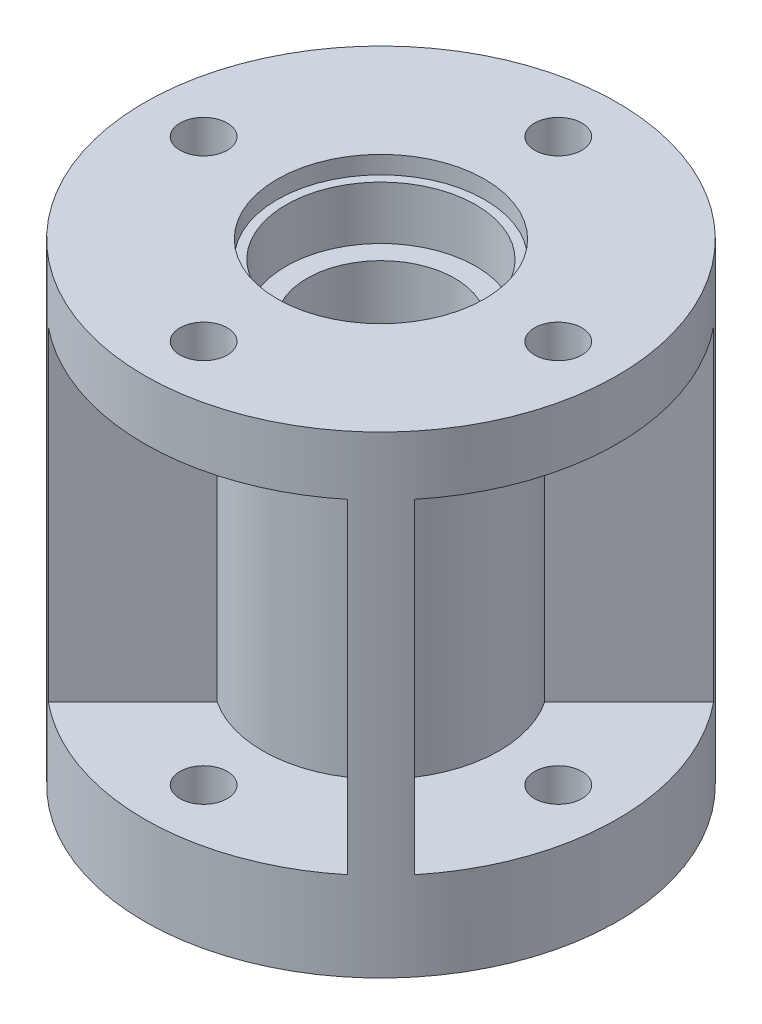
ISO-10303-21;
HEADER;
FILE_DESCRIPTION(('STEP AP214'),'2;1');
FILE_NAME('part.step','',(''),(''),'','','');
FILE_SCHEMA(('AUTOMOTIVE_DESIGN { 1 0 10303 214 1 1 1 1 }'));
ENDSEC;
DATA;
#1=APPLICATION_CONTEXT('core data for automotive mechanical design processes');
#2=APPLICATION_PROTOCOL_DEFINITION('international standard','automotive_design',2000,#1);
#3=PRODUCT_CONTEXT('',#1,'mechanical');
#4=PRODUCT('Part','Part','',(#3));
#5=PRODUCT_RELATED_PRODUCT_CATEGORY('part','',(#4));
#6=PRODUCT_DEFINITION_FORMATION('','',#4);
#7=PRODUCT_DEFINITION_CONTEXT('part definition',#1,'design');
#8=PRODUCT_DEFINITION('design','',#6,#7);
#9=PRODUCT_DEFINITION_SHAPE('','',#8);
#10=(LENGTH_UNIT() NAMED_UNIT(*) SI_UNIT(.MILLI.,.METRE.));
#11=(NAMED_UNIT(*) PLANE_ANGLE_UNIT() SI_UNIT($,.RADIAN.));
#12=(NAMED_UNIT(*) SI_UNIT($,.STERADIAN.) SOLID_ANGLE_UNIT());
#13=UNCERTAINTY_MEASURE_WITH_UNIT(LENGTH_MEASURE(1.E-05),#10,'distance_accuracy_value','');
#14=(GEOMETRIC_REPRESENTATION_CONTEXT(3) GLOBAL_UNCERTAINTY_ASSIGNED_CONTEXT((#13)) GLOBAL_UNIT_ASSIGNED_CONTEXT((#10,
#11,#12)) REPRESENTATION_CONTEXT('',''));
#15=CARTESIAN_POINT('',(0.,0.,0.));
#16=DIRECTION('',(0.,0.,1.));
#17=DIRECTION('',(1.,0.,0.));
#18=AXIS2_PLACEMENT_3D('',#15,#16,#17);
#19=CARTESIAN_POINT('',(0.,68.,0.));
#20=DIRECTION('',(0.,-1.,0.));
#21=DIRECTION('',(0.,0.,-1.));
#22=AXIS2_PLACEMENT_3D('',#19,#20,#21);
#23=CYLINDRICAL_SURFACE('',#22,20.);
#24=CARTESIAN_POINT('',(0.,70.,0.));
#25=DIRECTION('',(0.,1.,0.));
#26=DIRECTION('',(0.,0.,1.));
#27=AXIS2_PLACEMENT_3D('',#24,#25,#26);
#28=CIRCLE('',#27,20.);
#29=CARTESIAN_POINT('',(-11.0279793358048,70.,16.6848335852972));
#30=VERTEX_POINT('',#29);
#31=CARTESIAN_POINT('',(11.0279793358047,70.,16.6848335852973));
#32=VERTEX_POINT('',#31);
#33=EDGE_CURVE('E154',#30,#32,#28,.T.);
#34=ORIENTED_EDGE('',*,*,#33,.F.);
#35=DIRECTION('',(0.,-1.,0.));
#36=VECTOR('',#35,1.);
#37=CARTESIAN_POINT('',(-11.0279793358048,108.203579541999,16.6848335852972));
#38=LINE('',#37,#36);
#39=CARTESIAN_POINT('',(-11.0279793358048,15.,16.6848335852972));
#40=VERTEX_POINT('',#39);
#41=EDGE_CURVE('E224',#30,#40,#38,.T.);
#42=ORIENTED_EDGE('',*,*,#41,.T.);
#43=CARTESIAN_POINT('',(0.,15.,0.));
#44=DIRECTION('',(0.,1.,0.));
#45=DIRECTION('',(0.,0.,1.));
#46=AXIS2_PLACEMENT_3D('',#43,#44,#45);
#47=CIRCLE('',#46,20.);
#48=CARTESIAN_POINT('',(11.0279793358047,15.,16.6848335852973));
#49=VERTEX_POINT('',#48);
#50=EDGE_CURVE('E181',#40,#49,#47,.T.);
#51=ORIENTED_EDGE('',*,*,#50,.T.);
#52=DIRECTION('',(0.,-1.,0.));
#53=VECTOR('',#52,1.);
#54=CARTESIAN_POINT('',(11.0279793358047,108.203579541999,16.6848335852973));
#55=LINE('',#54,#53);
#56=EDGE_CURVE('E172',#32,#49,#55,.T.);
#57=ORIENTED_EDGE('',*,*,#56,.F.);
#58=EDGE_LOOP('',(#34,#42,#51,#57));
#59=FACE_BOUND('',#58,.T.);
#60=ADVANCED_FACE('F43',(#59),#23,.T.);
#61=CARTESIAN_POINT('',(16.6848335852971,70.,11.027979335805));
#62=VERTEX_POINT('',#61);
#63=CARTESIAN_POINT('',(16.6848335852973,70.,-11.0279793358048));
#64=VERTEX_POINT('',#63);
#65=EDGE_CURVE('E167',#62,#64,#28,.T.);
#66=ORIENTED_EDGE('',*,*,#65,.F.);
#67=DIRECTION('',(0.,-1.,0.));
#68=VECTOR('',#67,1.);
#69=CARTESIAN_POINT('',(16.6848335852971,108.203579541999,11.027979335805));
#70=LINE('',#69,#68);
#71=CARTESIAN_POINT('',(16.6848335852971,15.,11.027979335805));
#72=VERTEX_POINT('',#71);
#73=EDGE_CURVE('E184',#62,#72,#70,.T.);
#74=ORIENTED_EDGE('',*,*,#73,.T.);
#75=CARTESIAN_POINT('',(16.6848335852973,15.,-11.0279793358048));
#76=VERTEX_POINT('',#75);
#77=EDGE_CURVE('E274',#72,#76,#47,.T.);
#78=ORIENTED_EDGE('',*,*,#77,.T.);
#79=DIRECTION('',(0.,-1.,0.));
#80=VECTOR('',#79,1.);
#81=CARTESIAN_POINT('',(16.6848335852973,108.203579541999,-11.0279793358048));
#82=LINE('',#81,#80);
#83=EDGE_CURVE('E210',#64,#76,#82,.T.);
#84=ORIENTED_EDGE('',*,*,#83,.F.);
#85=EDGE_LOOP('',(#66,#74,#78,#84));
#86=FACE_BOUND('',#85,.T.);
#87=ADVANCED_FACE('F413',(#86),#23,.T.);
#88=CARTESIAN_POINT('',(11.0279793358049,70.,-16.6848335852972));
#89=VERTEX_POINT('',#88);
#90=CARTESIAN_POINT('',(-11.0279793358048,70.,-16.6848335852972));
#91=VERTEX_POINT('',#90);
#92=EDGE_CURVE('E415',#89,#91,#28,.T.);
#93=ORIENTED_EDGE('',*,*,#92,.F.);
#94=DIRECTION('',(0.,-1.,0.));
#95=VECTOR('',#94,1.);
#96=CARTESIAN_POINT('',(11.0279793358049,108.203579541999,-16.6848335852972));
#97=LINE('',#96,#95);
#98=CARTESIAN_POINT('',(11.0279793358049,15.,-16.6848335852972));
#99=VERTEX_POINT('',#98);
#100=EDGE_CURVE('E213',#89,#99,#97,.T.);
#101=ORIENTED_EDGE('',*,*,#100,.T.);
#102=CARTESIAN_POINT('',(-11.0279793358048,15.,-16.6848335852972));
#103=VERTEX_POINT('',#102);
#104=EDGE_CURVE('E365',#99,#103,#47,.T.);
#105=ORIENTED_EDGE('',*,*,#104,.T.);
#106=DIRECTION('',(0.,-1.,0.));
#107=VECTOR('',#106,1.);
#108=CARTESIAN_POINT('',(-11.0279793358048,108.203579541999,-16.6848335852972));
#109=LINE('',#108,#107);
#110=EDGE_CURVE('E231',#91,#103,#109,.T.);
#111=ORIENTED_EDGE('',*,*,#110,.F.);
#112=EDGE_LOOP('',(#93,#101,#105,#111));
#113=FACE_BOUND('',#112,.T.);
#114=ADVANCED_FACE('F451',(#113),#23,.T.);
#115=CARTESIAN_POINT('',(-16.6848335852972,70.,-11.0279793358049));
#116=VERTEX_POINT('',#115);
#117=CARTESIAN_POINT('',(-16.6848335852972,70.,11.0279793358049));
#118=VERTEX_POINT('',#117);
#119=EDGE_CURVE('E164',#116,#118,#28,.T.);
#120=ORIENTED_EDGE('',*,*,#119,.F.);
#121=DIRECTION('',(0.,-1.,0.));
#122=VECTOR('',#121,1.);
#123=CARTESIAN_POINT('',(-16.6848335852972,108.203579541999,-11.0279793358049));
#124=LINE('',#123,#122);
#125=CARTESIAN_POINT('',(-16.6848335852972,15.,-11.0279793358049));
#126=VERTEX_POINT('',#125);
#127=EDGE_CURVE('E203',#116,#126,#124,.T.);
#128=ORIENTED_EDGE('',*,*,#127,.T.);
#129=CARTESIAN_POINT('',(-16.6848335852972,15.,11.0279793358049));
#130=VERTEX_POINT('',#129);
#131=EDGE_CURVE('E270',#126,#130,#47,.T.);
#132=ORIENTED_EDGE('',*,*,#131,.T.);
#133=DIRECTION('',(0.,-1.,0.));
#134=VECTOR('',#133,1.);
#135=CARTESIAN_POINT('',(-16.6848335852972,108.203579541999,11.0279793358049));
#136=LINE('',#135,#134);
#137=EDGE_CURVE('E249',#118,#130,#136,.T.);
#138=ORIENTED_EDGE('',*,*,#137,.F.);
#139=EDGE_LOOP('',(#120,#128,#132,#138));
#140=FACE_BOUND('',#139,.T.);
#141=ADVANCED_FACE('F379',(#140),#23,.T.);
#142=CARTESIAN_POINT('',(-16.6848335852972,108.203579541999,11.0279793358049));
#143=DIRECTION('',(0.707106781186549,0.,0.707106781186546));
#144=DIRECTION('',(0.707106781186546,0.,-0.707106781186549));
#145=AXIS2_PLACEMENT_3D('',#142,#143,#144);
#146=PLANE('',#145);
#147=DIRECTION('',(-0.707106781186546,0.,0.707106781186549));
#148=VECTOR('',#147,1.);
#149=CARTESIAN_POINT('',(-16.6848335852972,70.,11.0279793358049));
#150=LINE('',#149,#148);
#151=CARTESIAN_POINT('',(-30.9709216836867,70.,25.3140674341945));
#152=VERTEX_POINT('',#151);
#153=EDGE_CURVE('E338',#118,#152,#150,.T.);
#154=ORIENTED_EDGE('',*,*,#153,.F.);
#155=ORIENTED_EDGE('',*,*,#137,.T.);
#156=DIRECTION('',(-0.707106781186546,0.,0.707106781186549));
#157=VECTOR('',#156,1.);
#158=CARTESIAN_POINT('',(-16.6848335852972,15.,11.0279793358049));
#159=LINE('',#158,#157);
#160=CARTESIAN_POINT('',(-30.9709216836867,15.,25.3140674341945));
#161=VERTEX_POINT('',#160);
#162=EDGE_CURVE('E244',#130,#161,#159,.T.);
#163=ORIENTED_EDGE('',*,*,#162,.T.);
#164=DIRECTION('',(0.,-1.,0.));
#165=VECTOR('',#164,1.);
#166=CARTESIAN_POINT('',(-30.9709216836867,108.203579541999,25.3140674341945));
#167=LINE('',#166,#165);
#168=EDGE_CURVE('E248',#152,#161,#167,.T.);
#169=ORIENTED_EDGE('',*,*,#168,.F.);
#170=EDGE_LOOP('',(#154,#155,#163,#169));
#171=FACE_BOUND('',#170,.T.);
#172=ADVANCED_FACE('F389',(#171),#146,.F.);
#173=CARTESIAN_POINT('',(-11.0279793358048,108.203579541999,16.6848335852972));
#174=DIRECTION('',(-0.707106781186549,0.,-0.707106781186546));
#175=DIRECTION('',(-0.707106781186546,0.,0.707106781186549));
#176=AXIS2_PLACEMENT_3D('',#173,#174,#175);
#177=PLANE('',#176);
#178=DIRECTION('',(0.707106781186546,0.,-0.707106781186549));
#179=VECTOR('',#178,1.);
#180=CARTESIAN_POINT('',(-11.0279793358048,70.,16.6848335852972));
#181=LINE('',#180,#179);
#182=CARTESIAN_POINT('',(-25.3140674341943,70.,30.9709216836868));
#183=VERTEX_POINT('',#182);
#184=EDGE_CURVE('E159',#183,#30,#181,.T.);
#185=ORIENTED_EDGE('',*,*,#184,.F.);
#186=DIRECTION('',(0.,-1.,0.));
#187=VECTOR('',#186,1.);
#188=CARTESIAN_POINT('',(-25.3140674341943,108.203579541999,30.9709216836868));
#189=LINE('',#188,#187);
#190=CARTESIAN_POINT('',(-25.3140674341943,15.,30.9709216836868));
#191=VERTEX_POINT('',#190);
#192=EDGE_CURVE('E63',#183,#191,#189,.T.);
#193=ORIENTED_EDGE('',*,*,#192,.T.);
#194=DIRECTION('',(0.707106781186546,0.,-0.707106781186549));
#195=VECTOR('',#194,1.);
#196=CARTESIAN_POINT('',(-11.0279793358048,15.,16.6848335852972));
#197=LINE('',#196,#195);
#198=EDGE_CURVE('E240',#191,#40,#197,.T.);
#199=ORIENTED_EDGE('',*,*,#198,.T.);
#200=ORIENTED_EDGE('',*,*,#41,.F.);
#201=EDGE_LOOP('',(#185,#193,#199,#200));
#202=FACE_BOUND('',#201,.T.);
#203=ADVANCED_FACE('F459',(#202),#177,.F.);
#204=CARTESIAN_POINT('',(-11.0279793358048,108.203579541999,-16.6848335852972));
#205=DIRECTION('',(-0.707106781186548,0.,0.707106781186547));
#206=DIRECTION('',(0.707106781186547,0.,0.707106781186548));
#207=AXIS2_PLACEMENT_3D('',#204,#205,#206);
#208=PLANE('',#207);
#209=DIRECTION('',(-0.707106781186547,0.,-0.707106781186548));
#210=VECTOR('',#209,1.);
#211=CARTESIAN_POINT('',(-11.0279793358048,70.,-16.6848335852972));
#212=LINE('',#211,#210);
#213=CARTESIAN_POINT('',(-25.3140674341943,70.,-30.9709216836868));
#214=VERTEX_POINT('',#213);
#215=EDGE_CURVE('E333',#91,#214,#212,.T.);
#216=ORIENTED_EDGE('',*,*,#215,.F.);
#217=ORIENTED_EDGE('',*,*,#110,.T.);
#218=DIRECTION('',(-0.707106781186546,0.,-0.707106781186548));
#219=VECTOR('',#218,1.);
#220=CARTESIAN_POINT('',(-11.0279793358048,15.,-16.6848335852972));
#221=LINE('',#220,#219);
#222=CARTESIAN_POINT('',(-25.3140674341943,15.,-30.9709216836868));
#223=VERTEX_POINT('',#222);
#224=EDGE_CURVE('E226',#103,#223,#221,.T.);
#225=ORIENTED_EDGE('',*,*,#224,.T.);
#226=DIRECTION('',(0.,-1.,0.));
#227=VECTOR('',#226,1.);
#228=CARTESIAN_POINT('',(-25.3140674341943,108.203579541999,-30.9709216836868));
#229=LINE('',#228,#227);
#230=EDGE_CURVE('E230',#214,#223,#229,.T.);
#231=ORIENTED_EDGE('',*,*,#230,.F.);
#232=EDGE_LOOP('',(#216,#217,#225,#231));
#233=FACE_BOUND('',#232,.T.);
#234=ADVANCED_FACE('F474',(#233),#208,.F.);
#235=CARTESIAN_POINT('',(-16.6848335852972,108.203579541999,-11.0279793358049));
#236=DIRECTION('',(0.707106781186548,0.,-0.707106781186547));
#237=DIRECTION('',(-0.707106781186547,0.,-0.707106781186548));
#238=AXIS2_PLACEMENT_3D('',#235,#236,#237);
#239=PLANE('',#238);
#240=DIRECTION('',(0.707106781186547,0.,0.707106781186548));
#241=VECTOR('',#240,1.);
#242=CARTESIAN_POINT('',(-16.6848335852972,70.,-11.0279793358049));
#243=LINE('',#242,#241);
#244=CARTESIAN_POINT('',(-30.9709216836867,70.,-25.3140674341944));
#245=VERTEX_POINT('',#244);
#246=EDGE_CURVE('E330',#245,#116,#243,.T.);
#247=ORIENTED_EDGE('',*,*,#246,.F.);
#248=DIRECTION('',(0.,-1.,0.));
#249=VECTOR('',#248,1.);
#250=CARTESIAN_POINT('',(-30.9709216836867,108.203579541999,-25.3140674341944));
#251=LINE('',#250,#249);
#252=CARTESIAN_POINT('',(-30.9709216836867,15.,-25.3140674341944));
#253=VERTEX_POINT('',#252);
#254=EDGE_CURVE('E225',#245,#253,#251,.T.);
#255=ORIENTED_EDGE('',*,*,#254,.T.);
#256=DIRECTION('',(0.707106781186547,0.,0.707106781186548));
#257=VECTOR('',#256,1.);
#258=CARTESIAN_POINT('',(-16.6848335852972,15.,-11.0279793358049));
#259=LINE('',#258,#257);
#260=EDGE_CURVE('E220',#253,#126,#259,.T.);
#261=ORIENTED_EDGE('',*,*,#260,.T.);
#262=ORIENTED_EDGE('',*,*,#127,.F.);
#263=EDGE_LOOP('',(#247,#255,#261,#262));
#264=FACE_BOUND('',#263,.T.);
#265=ADVANCED_FACE('F599',(#264),#239,.F.);
#266=CARTESIAN_POINT('',(16.6848335852973,108.203579541999,-11.0279793358048));
#267=DIRECTION('',(-0.707106781186544,0.,-0.707106781186551));
#268=DIRECTION('',(-0.707106781186551,0.,0.707106781186544));
#269=AXIS2_PLACEMENT_3D('',#266,#267,#268);
#270=PLANE('',#269);
#271=DIRECTION('',(0.707106781186551,0.,-0.707106781186544));
#272=VECTOR('',#271,1.);
#273=CARTESIAN_POINT('',(16.6848335852973,70.,-11.0279793358048));
#274=LINE('',#273,#272);
#275=CARTESIAN_POINT('',(30.9709216836869,70.,-25.3140674341942));
#276=VERTEX_POINT('',#275);
#277=EDGE_CURVE('E327',#64,#276,#274,.T.);
#278=ORIENTED_EDGE('',*,*,#277,.F.);
#279=ORIENTED_EDGE('',*,*,#83,.T.);
#280=DIRECTION('',(0.707106781186551,0.,-0.707106781186544));
#281=VECTOR('',#280,1.);
#282=CARTESIAN_POINT('',(16.6848335852973,15.,-11.0279793358048));
#283=LINE('',#282,#281);
#284=CARTESIAN_POINT('',(30.9709216836869,15.,-25.3140674341942));
#285=VERTEX_POINT('',#284);
#286=EDGE_CURVE('E205',#76,#285,#283,.T.);
#287=ORIENTED_EDGE('',*,*,#286,.T.);
#288=DIRECTION('',(0.,-1.,0.));
#289=VECTOR('',#288,1.);
#290=CARTESIAN_POINT('',(30.9709216836869,108.203579541999,-25.3140674341942));
#291=LINE('',#290,#289);
#292=EDGE_CURVE('E209',#276,#285,#291,.T.);
#293=ORIENTED_EDGE('',*,*,#292,.F.);
#294=EDGE_LOOP('',(#278,#279,#287,#293));
#295=FACE_BOUND('',#294,.T.);
#296=ADVANCED_FACE('F411',(#295),#270,.F.);
#297=CARTESIAN_POINT('',(11.0279793358049,108.203579541999,-16.6848335852972));
#298=DIRECTION('',(0.707106781186544,0.,0.707106781186551));
#299=DIRECTION('',(0.707106781186551,0.,-0.707106781186544));
#300=AXIS2_PLACEMENT_3D('',#297,#298,#299);
#301=PLANE('',#300);
#302=DIRECTION('',(-0.707106781186551,0.,0.707106781186544));
#303=VECTOR('',#302,1.);
#304=CARTESIAN_POINT('',(11.0279793358049,70.,-16.6848335852972));
#305=LINE('',#304,#303);
#306=CARTESIAN_POINT('',(25.3140674341945,70.,-30.9709216836866));
#307=VERTEX_POINT('',#306);
#308=EDGE_CURVE('E176',#307,#89,#305,.T.);
#309=ORIENTED_EDGE('',*,*,#308,.F.);
#310=DIRECTION('',(0.,-1.,0.));
#311=VECTOR('',#310,1.);
#312=CARTESIAN_POINT('',(25.3140674341945,108.203579541999,-30.9709216836866));
#313=LINE('',#312,#311);
#314=CARTESIAN_POINT('',(25.3140674341945,15.,-30.9709216836866));
#315=VERTEX_POINT('',#314);
#316=EDGE_CURVE('E204',#307,#315,#313,.T.);
#317=ORIENTED_EDGE('',*,*,#316,.T.);
#318=DIRECTION('',(-0.707106781186551,0.,0.707106781186544));
#319=VECTOR('',#318,1.);
#320=CARTESIAN_POINT('',(11.0279793358049,15.,-16.6848335852972));
#321=LINE('',#320,#319);
#322=EDGE_CURVE('E199',#315,#99,#321,.T.);
#323=ORIENTED_EDGE('',*,*,#322,.T.);
#324=ORIENTED_EDGE('',*,*,#100,.F.);
#325=EDGE_LOOP('',(#309,#317,#323,#324));
#326=FACE_BOUND('',#325,.T.);
#327=ADVANCED_FACE('F466',(#326),#301,.F.);
#328=CARTESIAN_POINT('',(11.0279793358047,108.203579541999,16.6848335852973));
#329=DIRECTION('',(0.707106781186554,0.,-0.707106781186542));
#330=DIRECTION('',(-0.707106781186542,0.,-0.707106781186554));
#331=AXIS2_PLACEMENT_3D('',#328,#329,#330);
#332=PLANE('',#331);
#333=DIRECTION('',(0.707106781186542,0.,0.707106781186554));
#334=VECTOR('',#333,1.);
#335=CARTESIAN_POINT('',(11.0279793358047,70.,16.6848335852973));
#336=LINE('',#335,#334);
#337=CARTESIAN_POINT('',(25.3140674341941,70.,30.970921683687));
#338=VERTEX_POINT('',#337);
#339=EDGE_CURVE('E157',#32,#338,#336,.T.);
#340=ORIENTED_EDGE('',*,*,#339,.F.);
#341=ORIENTED_EDGE('',*,*,#56,.T.);
#342=DIRECTION('',(0.707106781186542,0.,0.707106781186554));
#343=VECTOR('',#342,1.);
#344=CARTESIAN_POINT('',(11.0279793358047,15.,16.6848335852973));
#345=LINE('',#344,#343);
#346=CARTESIAN_POINT('',(25.3140674341941,15.,30.970921683687));
#347=VERTEX_POINT('',#346);
#348=EDGE_CURVE('E183',#49,#347,#345,.T.);
#349=ORIENTED_EDGE('',*,*,#348,.T.);
#350=DIRECTION('',(0.,-1.,0.));
#351=VECTOR('',#350,1.);
#352=CARTESIAN_POINT('',(25.3140674341941,108.203579541999,30.970921683687));
#353=LINE('',#352,#351);
#354=EDGE_CURVE('E174',#338,#347,#353,.T.);
#355=ORIENTED_EDGE('',*,*,#354,.F.);
#356=EDGE_LOOP('',(#340,#341,#349,#355));
#357=FACE_BOUND('',#356,.T.);
#358=ADVANCED_FACE('F170',(#357),#332,.F.);
#359=CARTESIAN_POINT('',(16.6848335852971,108.203579541999,11.027979335805));
#360=DIRECTION('',(-0.707106781186553,0.,0.707106781186542));
#361=DIRECTION('',(0.707106781186542,0.,0.707106781186553));
#362=AXIS2_PLACEMENT_3D('',#359,#360,#361);
#363=PLANE('',#362);
#364=DIRECTION('',(-0.707106781186542,0.,-0.707106781186553));
#365=VECTOR('',#364,1.);
#366=CARTESIAN_POINT('',(16.6848335852971,70.,11.027979335805));
#367=LINE('',#366,#365);
#368=CARTESIAN_POINT('',(30.9709216836866,70.,25.3140674341946));
#369=VERTEX_POINT('',#368);
#370=EDGE_CURVE('E11',#369,#62,#367,.T.);
#371=ORIENTED_EDGE('',*,*,#370,.F.);
#372=DIRECTION('',(0.,-1.,0.));
#373=VECTOR('',#372,1.);
#374=CARTESIAN_POINT('',(30.9709216836866,108.203579541999,25.3140674341946));
#375=LINE('',#374,#373);
#376=CARTESIAN_POINT('',(30.9709216836866,15.,25.3140674341946));
#377=VERTEX_POINT('',#376);
#378=EDGE_CURVE('E195',#369,#377,#375,.T.);
#379=ORIENTED_EDGE('',*,*,#378,.T.);
#380=DIRECTION('',(-0.707106781186542,0.,-0.707106781186553));
#381=VECTOR('',#380,1.);
#382=CARTESIAN_POINT('',(16.6848335852971,15.,11.027979335805));
#383=LINE('',#382,#381);
#384=EDGE_CURVE('E197',#377,#72,#383,.T.);
#385=ORIENTED_EDGE('',*,*,#384,.T.);
#386=ORIENTED_EDGE('',*,*,#73,.F.);
#387=EDGE_LOOP('',(#371,#379,#385,#386));
#388=FACE_BOUND('',#387,.T.);
#389=ADVANCED_FACE('F354',(#388),#363,.F.);
#390=CARTESIAN_POINT('',(0.,80.,0.));
#391=DIRECTION('',(0.,-1.,0.));
#392=DIRECTION('',(0.,0.,-1.));
#393=AXIS2_PLACEMENT_3D('',#390,#391,#392);
#394=CYLINDRICAL_SURFACE('',#393,16.05);
#395=CARTESIAN_POINT('',(0.,68.,0.));
#396=DIRECTION('',(0.,1.,0.));
#397=DIRECTION('',(0.,0.,1.));
#398=AXIS2_PLACEMENT_3D('',#395,#396,#397);
#399=CIRCLE('',#398,16.05);
#400=CARTESIAN_POINT('',(0.,68.,16.05));
#401=VERTEX_POINT('',#400);
#402=EDGE_CURVE('E253',#401,#401,#399,.T.);
#403=ORIENTED_EDGE('',*,*,#402,.F.);
#404=EDGE_LOOP('',(#403));
#405=FACE_BOUND('',#404,.T.);
#406=CARTESIAN_POINT('',(0.,77.,0.));
#407=DIRECTION('',(0.,1.,0.));
#408=DIRECTION('',(0.,0.,1.));
#409=AXIS2_PLACEMENT_3D('',#406,#407,#408);
#410=CIRCLE('',#409,16.05);
#411=CARTESIAN_POINT('',(0.,77.,16.05));
#412=VERTEX_POINT('',#411);
#413=EDGE_CURVE('E189',#412,#412,#410,.T.);
#414=ORIENTED_EDGE('',*,*,#413,.T.);
#415=EDGE_LOOP('',(#414));
#416=FACE_BOUND('',#415,.T.);
#417=ADVANCED_FACE('F498',(#405,#416),#394,.F.);
#418=CARTESIAN_POINT('',(0.,15.,0.));
#419=DIRECTION('',(0.,1.,0.));
#420=DIRECTION('',(0.,0.,1.));
#421=AXIS2_PLACEMENT_3D('',#418,#419,#420);
#422=PLANE('',#421);
#423=CARTESIAN_POINT('',(-1.02907469966573E-13,15.,30.0000000000001));
#424=DIRECTION('',(0.,1.,0.));
#425=DIRECTION('',(0.,0.,1.));
#426=AXIS2_PLACEMENT_3D('',#423,#424,#425);
#427=CIRCLE('',#426,4.00000000000007);
#428=CARTESIAN_POINT('',(-1.02907469966573E-13,15.,34.0000000000002));
#429=VERTEX_POINT('',#428);
#430=EDGE_CURVE('E304',#429,#429,#427,.F.);
#431=ORIENTED_EDGE('',*,*,#430,.T.);
#432=EDGE_LOOP('',(#431));
#433=FACE_BOUND('',#432,.T.);
#434=CARTESIAN_POINT('',(0.,15.,0.));
#435=DIRECTION('',(0.,1.,0.));
#436=DIRECTION('',(0.,0.,1.));
#437=AXIS2_PLACEMENT_3D('',#434,#435,#436);
#438=CIRCLE('',#437,40.);
#439=EDGE_CURVE('E54',#191,#347,#438,.T.);
#440=ORIENTED_EDGE('',*,*,#439,.T.);
#441=ORIENTED_EDGE('',*,*,#348,.F.);
#442=ORIENTED_EDGE('',*,*,#50,.F.);
#443=ORIENTED_EDGE('',*,*,#198,.F.);
#444=EDGE_LOOP('',(#440,#441,#442,#443));
#445=FACE_BOUND('',#444,.T.);
#446=ADVANCED_FACE('F496',(#433,#445),#422,.T.);
#447=CARTESIAN_POINT('',(30.,15.,1.04744440165294E-13));
#448=DIRECTION('',(0.,1.,0.));
#449=DIRECTION('',(0.,0.,1.));
#450=AXIS2_PLACEMENT_3D('',#447,#448,#449);
#451=CIRCLE('',#450,4.);
#452=CARTESIAN_POINT('',(30.,15.,4.0000000000001));
#453=VERTEX_POINT('',#452);
#454=EDGE_CURVE('E165',#453,#453,#451,.F.);
#455=ORIENTED_EDGE('',*,*,#454,.T.);
#456=EDGE_LOOP('',(#455));
#457=FACE_BOUND('',#456,.T.);
#458=ORIENTED_EDGE('',*,*,#77,.F.);
#459=ORIENTED_EDGE('',*,*,#384,.F.);
#460=EDGE_CURVE('E282',#377,#285,#438,.T.);
#461=ORIENTED_EDGE('',*,*,#460,.T.);
#462=ORIENTED_EDGE('',*,*,#286,.F.);
#463=EDGE_LOOP('',(#458,#459,#461,#462));
#464=FACE_BOUND('',#463,.T.);
#465=ADVANCED_FACE('F361',(#457,#464),#422,.T.);
#466=CARTESIAN_POINT('',(0.,15.,-30.));
#467=DIRECTION('',(0.,1.,0.));
#468=DIRECTION('',(0.,0.,1.));
#469=AXIS2_PLACEMENT_3D('',#466,#467,#468);
#470=CIRCLE('',#469,4.);
#471=CARTESIAN_POINT('',(0.,15.,-26.));
#472=VERTEX_POINT('',#471);
#473=EDGE_CURVE('E300',#472,#472,#470,.F.);
#474=ORIENTED_EDGE('',*,*,#473,.T.);
#475=EDGE_LOOP('',(#474));
#476=FACE_BOUND('',#475,.T.);
#477=ORIENTED_EDGE('',*,*,#104,.F.);
#478=ORIENTED_EDGE('',*,*,#322,.F.);
#479=EDGE_CURVE('E472',#315,#223,#438,.T.);
#480=ORIENTED_EDGE('',*,*,#479,.T.);
#481=ORIENTED_EDGE('',*,*,#224,.F.);
#482=EDGE_LOOP('',(#477,#478,#480,#481));
#483=FACE_BOUND('',#482,.T.);
#484=ADVANCED_FACE('F471',(#476,#483),#422,.T.);
#485=CARTESIAN_POINT('',(-29.9999999999996,15.,4.2632564145606E-13));
#486=DIRECTION('',(0.,1.,0.));
#487=DIRECTION('',(0.,0.,1.));
#488=AXIS2_PLACEMENT_3D('',#485,#486,#487);
#489=CIRCLE('',#488,4.00000000000083);
#490=CARTESIAN_POINT('',(-29.9999999999996,15.,4.00000000000126));
#491=VERTEX_POINT('',#490);
#492=EDGE_CURVE('E295',#491,#491,#489,.F.);
#493=ORIENTED_EDGE('',*,*,#492,.T.);
#494=EDGE_LOOP('',(#493));
#495=FACE_BOUND('',#494,.T.);
#496=ORIENTED_EDGE('',*,*,#131,.F.);
#497=ORIENTED_EDGE('',*,*,#260,.F.);
#498=EDGE_CURVE('E283',#253,#161,#438,.T.);
#499=ORIENTED_EDGE('',*,*,#498,.T.);
#500=ORIENTED_EDGE('',*,*,#162,.F.);
#501=EDGE_LOOP('',(#496,#497,#499,#500));
#502=FACE_BOUND('',#501,.T.);
#503=ADVANCED_FACE('F384',(#495,#502),#422,.T.);
#504=CARTESIAN_POINT('',(0.,68.,0.));
#505=DIRECTION('',(0.,1.,0.));
#506=DIRECTION('',(0.,0.,1.));
#507=AXIS2_PLACEMENT_3D('',#504,#505,#506);
#508=PLANE('',#507);
#509=CARTESIAN_POINT('',(0.,68.,0.));
#510=DIRECTION('',(0.,1.,0.));
#511=DIRECTION('',(0.,0.,1.));
#512=AXIS2_PLACEMENT_3D('',#509,#510,#511);
#513=CIRCLE('',#512,12.5);
#514=CARTESIAN_POINT('',(0.,68.,12.5));
#515=VERTEX_POINT('',#514);
#516=EDGE_CURVE('E266',#515,#515,#513,.T.);
#517=ORIENTED_EDGE('',*,*,#516,.F.);
#518=EDGE_LOOP('',(#517));
#519=FACE_BOUND('',#518,.T.);
#520=ORIENTED_EDGE('',*,*,#402,.T.);
#521=EDGE_LOOP('',(#520));
#522=FACE_BOUND('',#521,.T.);
#523=ADVANCED_FACE('F487',(#519,#522),#508,.T.);
#524=CARTESIAN_POINT('',(0.,0.,0.));
#525=DIRECTION('',(0.,1.,0.));
#526=DIRECTION('',(0.,0.,1.));
#527=AXIS2_PLACEMENT_3D('',#524,#525,#526);
#528=PLANE('',#527);
#529=CARTESIAN_POINT('',(0.,0.,-30.));
#530=DIRECTION('',(0.,1.,0.));
#531=DIRECTION('',(0.,0.,1.));
#532=AXIS2_PLACEMENT_3D('',#529,#530,#531);
#533=CIRCLE('',#532,4.);
#534=CARTESIAN_POINT('',(0.,0.,-26.));
#535=VERTEX_POINT('',#534);
#536=EDGE_CURVE('E520',#535,#535,#533,.T.);
#537=ORIENTED_EDGE('',*,*,#536,.T.);
#538=EDGE_LOOP('',(#537));
#539=FACE_BOUND('',#538,.T.);
#540=CARTESIAN_POINT('',(30.,0.,1.04744440165294E-13));
#541=DIRECTION('',(0.,1.,0.));
#542=DIRECTION('',(0.,0.,1.));
#543=AXIS2_PLACEMENT_3D('',#540,#541,#542);
#544=CIRCLE('',#543,4.);
#545=CARTESIAN_POINT('',(30.,0.,4.0000000000001));
#546=VERTEX_POINT('',#545);
#547=EDGE_CURVE('E527',#546,#546,#544,.T.);
#548=ORIENTED_EDGE('',*,*,#547,.T.);
#549=EDGE_LOOP('',(#548));
#550=FACE_BOUND('',#549,.T.);
#551=CARTESIAN_POINT('',(-1.02907469966573E-13,0.,30.0000000000001));
#552=DIRECTION('',(0.,1.,0.));
#553=DIRECTION('',(0.,0.,1.));
#554=AXIS2_PLACEMENT_3D('',#551,#552,#553);
#555=CIRCLE('',#554,4.00000000000007);
#556=CARTESIAN_POINT('',(-1.02907469966573E-13,0.,34.0000000000002));
#557=VERTEX_POINT('',#556);
#558=EDGE_CURVE('E535',#557,#557,#555,.T.);
#559=ORIENTED_EDGE('',*,*,#558,.T.);
#560=EDGE_LOOP('',(#559));
#561=FACE_BOUND('',#560,.T.);
#562=CARTESIAN_POINT('',(-29.9999999999996,0.,4.2632564145606E-13));
#563=DIRECTION('',(0.,1.,0.));
#564=DIRECTION('',(0.,0.,1.));
#565=AXIS2_PLACEMENT_3D('',#562,#563,#564);
#566=CIRCLE('',#565,4.00000000000083);
#567=CARTESIAN_POINT('',(-29.9999999999996,0.,4.00000000000126));
#568=VERTEX_POINT('',#567);
#569=EDGE_CURVE('E543',#568,#568,#566,.T.);
#570=ORIENTED_EDGE('',*,*,#569,.T.);
#571=EDGE_LOOP('',(#570));
#572=FACE_BOUND('',#571,.T.);
#573=CARTESIAN_POINT('',(0.,0.,0.));
#574=DIRECTION('',(0.,1.,0.));
#575=DIRECTION('',(0.,0.,1.));
#576=AXIS2_PLACEMENT_3D('',#573,#574,#575);
#577=CIRCLE('',#576,40.);
#578=CARTESIAN_POINT('',(0.,0.,40.));
#579=VERTEX_POINT('',#578);
#580=EDGE_CURVE('E278',#579,#579,#577,.T.);
#581=ORIENTED_EDGE('',*,*,#580,.F.);
#582=EDGE_LOOP('',(#581));
#583=FACE_BOUND('',#582,.T.);
#584=CARTESIAN_POINT('',(0.,0.,0.));
#585=DIRECTION('',(0.,1.,0.));
#586=DIRECTION('',(0.,0.,1.));
#587=AXIS2_PLACEMENT_3D('',#584,#585,#586);
#588=CIRCLE('',#587,12.5);
#589=CARTESIAN_POINT('',(0.,0.,12.5));
#590=VERTEX_POINT('',#589);
#591=EDGE_CURVE('E273',#590,#590,#588,.T.);
#592=ORIENTED_EDGE('',*,*,#591,.T.);
#593=EDGE_LOOP('',(#592));
#594=FACE_BOUND('',#593,.T.);
#595=ADVANCED_FACE('F480',(#539,#550,#561,#572,#583,#594),#528,.F.);
#596=CARTESIAN_POINT('',(0.,15.,0.));
#597=DIRECTION('',(0.,-1.,0.));
#598=DIRECTION('',(0.,0.,-1.));
#599=AXIS2_PLACEMENT_3D('',#596,#597,#598);
#600=CYLINDRICAL_SURFACE('',#599,40.);
#601=ORIENTED_EDGE('',*,*,#378,.F.);
#602=CARTESIAN_POINT('',(0.,70.,0.));
#603=DIRECTION('',(0.,1.,0.));
#604=DIRECTION('',(0.,0.,1.));
#605=AXIS2_PLACEMENT_3D('',#602,#603,#604);
#606=CIRCLE('',#605,40.);
#607=EDGE_CURVE('E177',#369,#276,#606,.T.);
#608=ORIENTED_EDGE('',*,*,#607,.T.);
#609=ORIENTED_EDGE('',*,*,#292,.T.);
#610=ORIENTED_EDGE('',*,*,#460,.F.);
#611=EDGE_LOOP('',(#601,#608,#609,#610));
#612=FACE_BOUND('',#611,.T.);
#613=ORIENTED_EDGE('',*,*,#316,.F.);
#614=EDGE_CURVE('E398',#307,#214,#606,.T.);
#615=ORIENTED_EDGE('',*,*,#614,.T.);
#616=ORIENTED_EDGE('',*,*,#230,.T.);
#617=ORIENTED_EDGE('',*,*,#479,.F.);
#618=EDGE_LOOP('',(#613,#615,#616,#617));
#619=FACE_BOUND('',#618,.T.);
#620=ORIENTED_EDGE('',*,*,#254,.F.);
#621=EDGE_CURVE('E323',#245,#152,#606,.T.);
#622=ORIENTED_EDGE('',*,*,#621,.T.);
#623=ORIENTED_EDGE('',*,*,#168,.T.);
#624=ORIENTED_EDGE('',*,*,#498,.F.);
#625=EDGE_LOOP('',(#620,#622,#623,#624));
#626=FACE_BOUND('',#625,.T.);
#627=EDGE_CURVE('E321',#183,#338,#606,.T.);
#628=ORIENTED_EDGE('',*,*,#627,.T.);
#629=ORIENTED_EDGE('',*,*,#354,.T.);
#630=ORIENTED_EDGE('',*,*,#439,.F.);
#631=ORIENTED_EDGE('',*,*,#192,.F.);
#632=EDGE_LOOP('',(#628,#629,#630,#631));
#633=FACE_BOUND('',#632,.T.);
#634=CARTESIAN_POINT('',(0.,80.,0.));
#635=DIRECTION('',(0.,1.,0.));
#636=DIRECTION('',(0.,0.,1.));
#637=AXIS2_PLACEMENT_3D('',#634,#635,#636);
#638=CIRCLE('',#637,40.);
#639=CARTESIAN_POINT('',(0.,80.,40.));
#640=VERTEX_POINT('',#639);
#641=EDGE_CURVE('E243',#640,#640,#638,.T.);
#642=ORIENTED_EDGE('',*,*,#641,.F.);
#643=EDGE_LOOP('',(#642));
#644=FACE_BOUND('',#643,.T.);
#645=ORIENTED_EDGE('',*,*,#580,.T.);
#646=EDGE_LOOP('',(#645));
#647=FACE_BOUND('',#646,.T.);
#648=ADVANCED_FACE('F45',(#612,#619,#626,#633,#644,#647),#600,.T.);
#649=CARTESIAN_POINT('',(0.,15.,0.));
#650=DIRECTION('',(0.,-1.,0.));
#651=DIRECTION('',(0.,0.,-1.));
#652=AXIS2_PLACEMENT_3D('',#649,#650,#651);
#653=CYLINDRICAL_SURFACE('',#652,12.5);
#654=ORIENTED_EDGE('',*,*,#591,.F.);
#655=EDGE_LOOP('',(#654));
#656=FACE_BOUND('',#655,.T.);
#657=ORIENTED_EDGE('',*,*,#516,.T.);
#658=EDGE_LOOP('',(#657));
#659=FACE_BOUND('',#658,.T.);
#660=ADVANCED_FACE('F479',(#656,#659),#653,.F.);
#661=CARTESIAN_POINT('',(0.,80.,0.));
#662=DIRECTION('',(0.,1.,0.));
#663=DIRECTION('',(0.,0.,1.));
#664=AXIS2_PLACEMENT_3D('',#661,#662,#663);
#665=PLANE('',#664);
#666=CARTESIAN_POINT('',(0.,80.,-30.));
#667=DIRECTION('',(0.,1.,0.));
#668=DIRECTION('',(0.,0.,1.));
#669=AXIS2_PLACEMENT_3D('',#666,#667,#668);
#670=CIRCLE('',#669,4.);
#671=CARTESIAN_POINT('',(0.,80.,-26.));
#672=VERTEX_POINT('',#671);
#673=EDGE_CURVE('E296',#672,#672,#670,.T.);
#674=ORIENTED_EDGE('',*,*,#673,.F.);
#675=EDGE_LOOP('',(#674));
#676=FACE_BOUND('',#675,.T.);
#677=CARTESIAN_POINT('',(30.,80.,1.04744440165294E-13));
#678=DIRECTION('',(0.,1.,0.));
#679=DIRECTION('',(0.,0.,1.));
#680=AXIS2_PLACEMENT_3D('',#677,#678,#679);
#681=CIRCLE('',#680,4.);
#682=CARTESIAN_POINT('',(30.,80.,4.0000000000001));
#683=VERTEX_POINT('',#682);
#684=EDGE_CURVE('E523',#683,#683,#681,.T.);
#685=ORIENTED_EDGE('',*,*,#684,.F.);
#686=EDGE_LOOP('',(#685));
#687=FACE_BOUND('',#686,.T.);
#688=CARTESIAN_POINT('',(-1.02907469966573E-13,80.,30.0000000000001));
#689=DIRECTION('',(0.,1.,0.));
#690=DIRECTION('',(0.,0.,1.));
#691=AXIS2_PLACEMENT_3D('',#688,#689,#690);
#692=CIRCLE('',#691,4.00000000000007);
#693=CARTESIAN_POINT('',(-1.02907469966573E-13,80.,34.0000000000002));
#694=VERTEX_POINT('',#693);
#695=EDGE_CURVE('E531',#694,#694,#692,.T.);
#696=ORIENTED_EDGE('',*,*,#695,.F.);
#697=EDGE_LOOP('',(#696));
#698=FACE_BOUND('',#697,.T.);
#699=CARTESIAN_POINT('',(-29.9999999999996,80.,4.2632564145606E-13));
#700=DIRECTION('',(0.,1.,0.));
#701=DIRECTION('',(0.,0.,1.));
#702=AXIS2_PLACEMENT_3D('',#699,#700,#701);
#703=CIRCLE('',#702,4.00000000000083);
#704=CARTESIAN_POINT('',(-29.9999999999996,80.,4.00000000000126));
#705=VERTEX_POINT('',#704);
#706=EDGE_CURVE('E539',#705,#705,#703,.T.);
#707=ORIENTED_EDGE('',*,*,#706,.F.);
#708=EDGE_LOOP('',(#707));
#709=FACE_BOUND('',#708,.T.);
#710=ORIENTED_EDGE('',*,*,#641,.T.);
#711=EDGE_LOOP('',(#710));
#712=FACE_BOUND('',#711,.T.);
#713=CARTESIAN_POINT('',(0.,80.,0.));
#714=DIRECTION('',(0.,1.,0.));
#715=DIRECTION('',(0.,0.,1.));
#716=AXIS2_PLACEMENT_3D('',#713,#714,#715);
#717=CIRCLE('',#716,17.55);
#718=CARTESIAN_POINT('',(0.,80.,17.55));
#719=VERTEX_POINT('',#718);
#720=EDGE_CURVE('E341',#719,#719,#717,.T.);
#721=ORIENTED_EDGE('',*,*,#720,.F.);
#722=EDGE_LOOP('',(#721));
#723=FACE_BOUND('',#722,.T.);
#724=ADVANCED_FACE('F485',(#676,#687,#698,#709,#712,#723),#665,.T.);
#725=CARTESIAN_POINT('',(0.,77.,0.));
#726=DIRECTION('',(0.,1.,0.));
#727=DIRECTION('',(0.,0.,1.));
#728=AXIS2_PLACEMENT_3D('',#725,#726,#727);
#729=CYLINDRICAL_SURFACE('',#728,17.55);
#730=CARTESIAN_POINT('',(0.,77.,0.));
#731=DIRECTION('',(0.,1.,0.));
#732=DIRECTION('',(0.,0.,1.));
#733=AXIS2_PLACEMENT_3D('',#730,#731,#732);
#734=CIRCLE('',#733,17.55);
#735=CARTESIAN_POINT('',(0.,77.,17.55));
#736=VERTEX_POINT('',#735);
#737=EDGE_CURVE('E289',#736,#736,#734,.T.);
#738=ORIENTED_EDGE('',*,*,#737,.F.);
#739=EDGE_LOOP('',(#738));
#740=FACE_BOUND('',#739,.T.);
#741=ORIENTED_EDGE('',*,*,#720,.T.);
#742=EDGE_LOOP('',(#741));
#743=FACE_BOUND('',#742,.T.);
#744=ADVANCED_FACE('F437',(#740,#743),#729,.F.);
#745=CARTESIAN_POINT('',(0.,77.,0.));
#746=DIRECTION('',(0.,1.,0.));
#747=DIRECTION('',(0.,0.,1.));
#748=AXIS2_PLACEMENT_3D('',#745,#746,#747);
#749=PLANE('',#748);
#750=ORIENTED_EDGE('',*,*,#413,.F.);
#751=EDGE_LOOP('',(#750));
#752=FACE_BOUND('',#751,.T.);
#753=ORIENTED_EDGE('',*,*,#737,.T.);
#754=EDGE_LOOP('',(#753));
#755=FACE_BOUND('',#754,.T.);
#756=ADVANCED_FACE('F429',(#752,#755),#749,.T.);
#757=CARTESIAN_POINT('',(0.,70.,0.));
#758=DIRECTION('',(0.,1.,0.));
#759=DIRECTION('',(0.,0.,1.));
#760=AXIS2_PLACEMENT_3D('',#757,#758,#759);
#761=PLANE('',#760);
#762=CARTESIAN_POINT('',(30.,70.,1.04744440165294E-13));
#763=DIRECTION('',(0.,1.,0.));
#764=DIRECTION('',(0.,0.,1.));
#765=AXIS2_PLACEMENT_3D('',#762,#763,#764);
#766=CIRCLE('',#765,4.);
#767=CARTESIAN_POINT('',(30.,70.,4.0000000000001));
#768=VERTEX_POINT('',#767);
#769=EDGE_CURVE('E47',#768,#768,#766,.F.);
#770=ORIENTED_EDGE('',*,*,#769,.F.);
#771=EDGE_LOOP('',(#770));
#772=FACE_BOUND('',#771,.T.);
#773=ORIENTED_EDGE('',*,*,#65,.T.);
#774=ORIENTED_EDGE('',*,*,#277,.T.);
#775=ORIENTED_EDGE('',*,*,#607,.F.);
#776=ORIENTED_EDGE('',*,*,#370,.T.);
#777=EDGE_LOOP('',(#773,#774,#775,#776));
#778=FACE_BOUND('',#777,.T.);
#779=ADVANCED_FACE('F427',(#772,#778),#761,.F.);
#780=CARTESIAN_POINT('',(-1.02907469966573E-13,70.,30.0000000000001));
#781=DIRECTION('',(0.,1.,0.));
#782=DIRECTION('',(0.,0.,1.));
#783=AXIS2_PLACEMENT_3D('',#780,#781,#782);
#784=CIRCLE('',#783,4.00000000000007);
#785=CARTESIAN_POINT('',(-1.02907469966573E-13,70.,34.0000000000002));
#786=VERTEX_POINT('',#785);
#787=EDGE_CURVE('E301',#786,#786,#784,.F.);
#788=ORIENTED_EDGE('',*,*,#787,.F.);
#789=EDGE_LOOP('',(#788));
#790=FACE_BOUND('',#789,.T.);
#791=ORIENTED_EDGE('',*,*,#627,.F.);
#792=ORIENTED_EDGE('',*,*,#184,.T.);
#793=ORIENTED_EDGE('',*,*,#33,.T.);
#794=ORIENTED_EDGE('',*,*,#339,.T.);
#795=EDGE_LOOP('',(#791,#792,#793,#794));
#796=FACE_BOUND('',#795,.T.);
#797=ADVANCED_FACE('F156',(#790,#796),#761,.F.);
#798=CARTESIAN_POINT('',(0.,70.,-30.));
#799=DIRECTION('',(0.,1.,0.));
#800=DIRECTION('',(0.,0.,1.));
#801=AXIS2_PLACEMENT_3D('',#798,#799,#800);
#802=CIRCLE('',#801,4.);
#803=CARTESIAN_POINT('',(0.,70.,-26.));
#804=VERTEX_POINT('',#803);
#805=EDGE_CURVE('E297',#804,#804,#802,.F.);
#806=ORIENTED_EDGE('',*,*,#805,.F.);
#807=EDGE_LOOP('',(#806));
#808=FACE_BOUND('',#807,.T.);
#809=ORIENTED_EDGE('',*,*,#92,.T.);
#810=ORIENTED_EDGE('',*,*,#215,.T.);
#811=ORIENTED_EDGE('',*,*,#614,.F.);
#812=ORIENTED_EDGE('',*,*,#308,.T.);
#813=EDGE_LOOP('',(#809,#810,#811,#812));
#814=FACE_BOUND('',#813,.T.);
#815=ADVANCED_FACE('F431',(#808,#814),#761,.F.);
#816=CARTESIAN_POINT('',(-29.9999999999996,70.,4.2632564145606E-13));
#817=DIRECTION('',(0.,1.,0.));
#818=DIRECTION('',(0.,0.,1.));
#819=AXIS2_PLACEMENT_3D('',#816,#817,#818);
#820=CIRCLE('',#819,4.00000000000083);
#821=CARTESIAN_POINT('',(-29.9999999999996,70.,4.00000000000126));
#822=VERTEX_POINT('',#821);
#823=EDGE_CURVE('E291',#822,#822,#820,.F.);
#824=ORIENTED_EDGE('',*,*,#823,.F.);
#825=EDGE_LOOP('',(#824));
#826=FACE_BOUND('',#825,.T.);
#827=ORIENTED_EDGE('',*,*,#119,.T.);
#828=ORIENTED_EDGE('',*,*,#153,.T.);
#829=ORIENTED_EDGE('',*,*,#621,.F.);
#830=ORIENTED_EDGE('',*,*,#246,.T.);
#831=EDGE_LOOP('',(#827,#828,#829,#830));
#832=FACE_BOUND('',#831,.T.);
#833=ADVANCED_FACE('F392',(#826,#832),#761,.F.);
#834=CARTESIAN_POINT('',(-29.9999999999996,91.3137084989871,4.2632564145606E-13));
#835=DIRECTION('',(0.,-1.,0.));
#836=DIRECTION('',(0.,0.,-1.));
#837=AXIS2_PLACEMENT_3D('',#834,#835,#836);
#838=CYLINDRICAL_SURFACE('',#837,4.00000000000083);
#839=ORIENTED_EDGE('',*,*,#706,.T.);
#840=EDGE_LOOP('',(#839));
#841=FACE_BOUND('',#840,.T.);
#842=ORIENTED_EDGE('',*,*,#823,.T.);
#843=EDGE_LOOP('',(#842));
#844=FACE_BOUND('',#843,.T.);
#845=ADVANCED_FACE('F442',(#841,#844),#838,.F.);
#846=CARTESIAN_POINT('',(0.,91.3137084989871,-30.));
#847=DIRECTION('',(0.,-1.,0.));
#848=DIRECTION('',(0.,0.,-1.));
#849=AXIS2_PLACEMENT_3D('',#846,#847,#848);
#850=CYLINDRICAL_SURFACE('',#849,4.);
#851=ORIENTED_EDGE('',*,*,#673,.T.);
#852=EDGE_LOOP('',(#851));
#853=FACE_BOUND('',#852,.T.);
#854=ORIENTED_EDGE('',*,*,#805,.T.);
#855=EDGE_LOOP('',(#854));
#856=FACE_BOUND('',#855,.T.);
#857=ADVANCED_FACE('F564',(#853,#856),#850,.F.);
#858=CARTESIAN_POINT('',(-1.02907469966573E-13,91.3137084989871,30.0000000000001));
#859=DIRECTION('',(0.,-1.,0.));
#860=DIRECTION('',(0.,0.,-1.));
#861=AXIS2_PLACEMENT_3D('',#858,#859,#860);
#862=CYLINDRICAL_SURFACE('',#861,4.00000000000007);
#863=ORIENTED_EDGE('',*,*,#695,.T.);
#864=EDGE_LOOP('',(#863));
#865=FACE_BOUND('',#864,.T.);
#866=ORIENTED_EDGE('',*,*,#787,.T.);
#867=EDGE_LOOP('',(#866));
#868=FACE_BOUND('',#867,.T.);
#869=ADVANCED_FACE('F560',(#865,#868),#862,.F.);
#870=CARTESIAN_POINT('',(30.,91.3137084989871,1.04744440165294E-13));
#871=DIRECTION('',(0.,-1.,0.));
#872=DIRECTION('',(0.,0.,-1.));
#873=AXIS2_PLACEMENT_3D('',#870,#871,#872);
#874=CYLINDRICAL_SURFACE('',#873,4.);
#875=ORIENTED_EDGE('',*,*,#684,.T.);
#876=EDGE_LOOP('',(#875));
#877=FACE_BOUND('',#876,.T.);
#878=ORIENTED_EDGE('',*,*,#769,.T.);
#879=EDGE_LOOP('',(#878));
#880=FACE_BOUND('',#879,.T.);
#881=ADVANCED_FACE('F425',(#877,#880),#874,.F.);
#882=ORIENTED_EDGE('',*,*,#492,.F.);
#883=EDGE_LOOP('',(#882));
#884=FACE_BOUND('',#883,.T.);
#885=ORIENTED_EDGE('',*,*,#569,.F.);
#886=EDGE_LOOP('',(#885));
#887=FACE_BOUND('',#886,.T.);
#888=ADVANCED_FACE('F550',(#884,#887),#838,.F.);
#889=ORIENTED_EDGE('',*,*,#430,.F.);
#890=EDGE_LOOP('',(#889));
#891=FACE_BOUND('',#890,.T.);
#892=ORIENTED_EDGE('',*,*,#558,.F.);
#893=EDGE_LOOP('',(#892));
#894=FACE_BOUND('',#893,.T.);
#895=ADVANCED_FACE('F552',(#891,#894),#862,.F.);
#896=ORIENTED_EDGE('',*,*,#454,.F.);
#897=EDGE_LOOP('',(#896));
#898=FACE_BOUND('',#897,.T.);
#899=ORIENTED_EDGE('',*,*,#547,.F.);
#900=EDGE_LOOP('',(#899));
#901=FACE_BOUND('',#900,.T.);
#902=ADVANCED_FACE('F557',(#898,#901),#874,.F.);
#903=ORIENTED_EDGE('',*,*,#473,.F.);
#904=EDGE_LOOP('',(#903));
#905=FACE_BOUND('',#904,.T.);
#906=ORIENTED_EDGE('',*,*,#536,.F.);
#907=EDGE_LOOP('',(#906));
#908=FACE_BOUND('',#907,.T.);
#909=ADVANCED_FACE('F571',(#905,#908),#850,.F.);
#910=CLOSED_SHELL('',(#60,#87,#114,#141,#172,#203,#234,#265,#296,#327,#358,#389,#417,#446,#465,
#484,#503,#523,#595,#648,#660,#724,#744,#756,#779,#797,#815,#833,#845,#857,#869,#881,#888,#895,
#902,#909));
#911=MANIFOLD_SOLID_BREP('B2',#910);
#912=ADVANCED_BREP_SHAPE_REPRESENTATION('',(#18,#911),#14);
#913=SHAPE_DEFINITION_REPRESENTATION(#9,#912);
ENDSEC;
END-ISO-10303-21;
